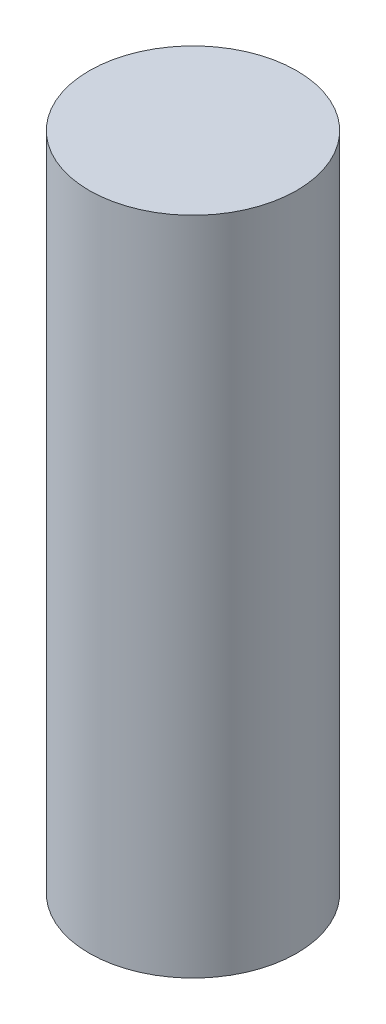
ISO-10303-21;
HEADER;
FILE_DESCRIPTION(('STEP AP214'),'2;1');
FILE_NAME('part.step','',(''),(''),'','','');
FILE_SCHEMA(('AUTOMOTIVE_DESIGN { 1 0 10303 214 1 1 1 1 }'));
ENDSEC;
DATA;
#1=APPLICATION_CONTEXT('core data for automotive mechanical design processes');
#2=APPLICATION_PROTOCOL_DEFINITION('international standard','automotive_design',2000,#1);
#3=PRODUCT_CONTEXT('',#1,'mechanical');
#4=PRODUCT('Part','Part','',(#3));
#5=PRODUCT_RELATED_PRODUCT_CATEGORY('part','',(#4));
#6=PRODUCT_DEFINITION_FORMATION('','',#4);
#7=PRODUCT_DEFINITION_CONTEXT('part definition',#1,'design');
#8=PRODUCT_DEFINITION('design','',#6,#7);
#9=PRODUCT_DEFINITION_SHAPE('','',#8);
#10=(LENGTH_UNIT() NAMED_UNIT(*) SI_UNIT(.MILLI.,.METRE.));
#11=(NAMED_UNIT(*) PLANE_ANGLE_UNIT() SI_UNIT($,.RADIAN.));
#12=(NAMED_UNIT(*) SI_UNIT($,.STERADIAN.) SOLID_ANGLE_UNIT());
#13=UNCERTAINTY_MEASURE_WITH_UNIT(LENGTH_MEASURE(1.E-05),#10,'distance_accuracy_value','');
#14=(GEOMETRIC_REPRESENTATION_CONTEXT(3) GLOBAL_UNCERTAINTY_ASSIGNED_CONTEXT((#13)) GLOBAL_UNIT_ASSIGNED_CONTEXT((#10,
#11,#12)) REPRESENTATION_CONTEXT('',''));
#15=CARTESIAN_POINT('',(0.,0.,0.));
#16=DIRECTION('',(0.,0.,1.));
#17=DIRECTION('',(1.,0.,0.));
#18=AXIS2_PLACEMENT_3D('',#15,#16,#17);
#19=CARTESIAN_POINT('',(6.33292313800711,8.8591956643176,8.23576192699096));
#20=DIRECTION('',(0.,1.,0.));
#21=DIRECTION('',(-1.,0.,0.));
#22=AXIS2_PLACEMENT_3D('',#19,#20,#21);
#23=PLANE('',#22);
#24=CARTESIAN_POINT('',(-63.9301591270672,8.8591956643176,-7.04527770769894));
#25=DIRECTION('',(0.,1.,0.));
#26=DIRECTION('',(0.,0.,1.));
#27=AXIS2_PLACEMENT_3D('',#24,#25,#26);
#28=CIRCLE('',#27,2.45);
#29=CARTESIAN_POINT('',(-63.9301591270672,8.8591956643176,-4.59527770769894));
#30=VERTEX_POINT('',#29);
#31=EDGE_CURVE('E10',#30,#30,#28,.F.);
#32=ORIENTED_EDGE('',*,*,#31,.F.);
#33=EDGE_LOOP('',(#32));
#34=FACE_BOUND('',#33,.T.);
#35=ADVANCED_FACE('F15',(#34),#23,.T.);
#36=CARTESIAN_POINT('',(-18.0682436398347,-6.7408043356824,3.834759141012));
#37=DIRECTION('',(0.,-1.,0.));
#38=DIRECTION('',(1.,0.,0.));
#39=AXIS2_PLACEMENT_3D('',#36,#37,#38);
#40=PLANE('',#39);
#41=CARTESIAN_POINT('',(-63.9301591270672,-6.7408043356824,-7.04527770769894));
#42=DIRECTION('',(0.,-1.,0.));
#43=DIRECTION('',(0.,0.,-1.));
#44=AXIS2_PLACEMENT_3D('',#41,#42,#43);
#45=CIRCLE('',#44,2.45);
#46=CARTESIAN_POINT('',(-63.9301591270672,-6.7408043356824,-9.49527770769894));
#47=VERTEX_POINT('',#46);
#48=EDGE_CURVE('E22',#47,#47,#45,.T.);
#49=ORIENTED_EDGE('',*,*,#48,.T.);
#50=EDGE_LOOP('',(#49));
#51=FACE_BOUND('',#50,.T.);
#52=ADVANCED_FACE('F30',(#51),#40,.T.);
#53=CARTESIAN_POINT('',(-63.9301591270672,8.8611956643176,-7.04527770769894));
#54=DIRECTION('',(0.,-1.,0.));
#55=DIRECTION('',(0.,0.,-1.));
#56=AXIS2_PLACEMENT_3D('',#53,#54,#55);
#57=CYLINDRICAL_SURFACE('',#56,2.45);
#58=ORIENTED_EDGE('',*,*,#48,.F.);
#59=EDGE_LOOP('',(#58));
#60=FACE_BOUND('',#59,.T.);
#61=ORIENTED_EDGE('',*,*,#31,.T.);
#62=EDGE_LOOP('',(#61));
#63=FACE_BOUND('',#62,.T.);
#64=ADVANCED_FACE('F32',(#60,#63),#57,.T.);
#65=CLOSED_SHELL('',(#35,#52,#64));
#66=MANIFOLD_SOLID_BREP('B1',#65);
#67=ADVANCED_BREP_SHAPE_REPRESENTATION('',(#18,#66),#14);
#68=SHAPE_DEFINITION_REPRESENTATION(#9,#67);
ENDSEC;
END-ISO-10303-21;
